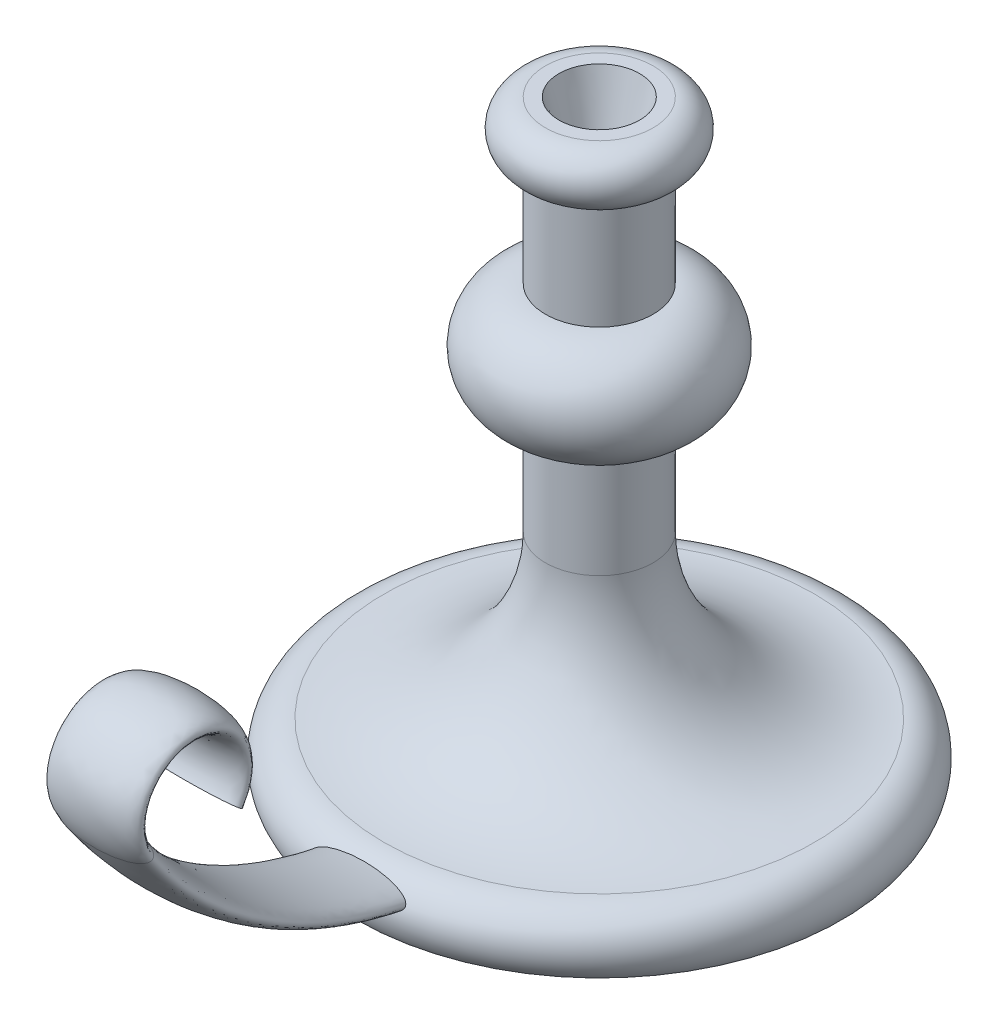
ISO-10303-21;
HEADER;
FILE_DESCRIPTION(('STEP AP214'),'2;1');
FILE_NAME('part.step','',(''),(''),'','','');
FILE_SCHEMA(('AUTOMOTIVE_DESIGN { 1 0 10303 214 1 1 1 1 }'));
ENDSEC;
DATA;
#1=APPLICATION_CONTEXT('core data for automotive mechanical design processes');
#2=APPLICATION_PROTOCOL_DEFINITION('international standard','automotive_design',2000,#1);
#3=PRODUCT_CONTEXT('',#1,'mechanical');
#4=PRODUCT('Part','Part','',(#3));
#5=PRODUCT_RELATED_PRODUCT_CATEGORY('part','',(#4));
#6=PRODUCT_DEFINITION_FORMATION('','',#4);
#7=PRODUCT_DEFINITION_CONTEXT('part definition',#1,'design');
#8=PRODUCT_DEFINITION('design','',#6,#7);
#9=PRODUCT_DEFINITION_SHAPE('','',#8);
#10=(LENGTH_UNIT() NAMED_UNIT(*) SI_UNIT(.MILLI.,.METRE.));
#11=(NAMED_UNIT(*) PLANE_ANGLE_UNIT() SI_UNIT($,.RADIAN.));
#12=(NAMED_UNIT(*) SI_UNIT($,.STERADIAN.) SOLID_ANGLE_UNIT());
#13=UNCERTAINTY_MEASURE_WITH_UNIT(LENGTH_MEASURE(1.E-05),#10,'distance_accuracy_value','');
#14=(GEOMETRIC_REPRESENTATION_CONTEXT(3) GLOBAL_UNCERTAINTY_ASSIGNED_CONTEXT((#13)) GLOBAL_UNIT_ASSIGNED_CONTEXT((#10,
#11,#12)) REPRESENTATION_CONTEXT('',''));
#15=CARTESIAN_POINT('',(0.,0.,0.));
#16=DIRECTION('',(0.,0.,1.));
#17=DIRECTION('',(1.,0.,0.));
#18=AXIS2_PLACEMENT_3D('',#15,#16,#17);
#19=CARTESIAN_POINT('',(0.,0.,0.));
#20=DIRECTION('',(0.,-1.,0.));
#21=DIRECTION('',(0.,0.,-1.));
#22=AXIS2_PLACEMENT_3D('',#19,#20,#21);
#23=PLANE('',#22);
#24=CARTESIAN_POINT('',(0.,0.,0.));
#25=DIRECTION('',(0.,-1.,0.));
#26=DIRECTION('',(0.,0.,-1.));
#27=AXIS2_PLACEMENT_3D('',#24,#25,#26);
#28=CIRCLE('',#27,90.);
#29=CARTESIAN_POINT('',(0.,0.,-90.));
#30=VERTEX_POINT('',#29);
#31=EDGE_CURVE('E78',#30,#30,#28,.T.);
#32=ORIENTED_EDGE('',*,*,#31,.T.);
#33=EDGE_LOOP('',(#32));
#34=FACE_BOUND('',#33,.T.);
#35=ADVANCED_FACE('F38',(#34),#23,.T.);
#36=CARTESIAN_POINT('',(0.,220.,0.));
#37=DIRECTION('',(0.,1.,0.));
#38=DIRECTION('',(0.,0.,1.));
#39=AXIS2_PLACEMENT_3D('',#36,#37,#38);
#40=PLANE('',#39);
#41=CARTESIAN_POINT('',(0.,220.,0.));
#42=DIRECTION('',(0.,1.,0.));
#43=DIRECTION('',(0.,0.,1.));
#44=AXIS2_PLACEMENT_3D('',#41,#42,#43);
#45=CIRCLE('',#44,15.);
#46=CARTESIAN_POINT('',(0.,220.,15.));
#47=VERTEX_POINT('',#46);
#48=EDGE_CURVE('E94',#47,#47,#45,.T.);
#49=ORIENTED_EDGE('',*,*,#48,.F.);
#50=EDGE_LOOP('',(#49));
#51=FACE_BOUND('',#50,.T.);
#52=CARTESIAN_POINT('',(0.,220.,0.));
#53=DIRECTION('',(0.,-1.,0.));
#54=DIRECTION('',(0.,0.,-1.));
#55=AXIS2_PLACEMENT_3D('',#52,#53,#54);
#56=CIRCLE('',#55,20.);
#57=CARTESIAN_POINT('',(0.,220.,-20.));
#58=VERTEX_POINT('',#57);
#59=EDGE_CURVE('E50',#58,#58,#56,.T.);
#60=ORIENTED_EDGE('',*,*,#59,.F.);
#61=EDGE_LOOP('',(#60));
#62=FACE_BOUND('',#61,.T.);
#63=ADVANCED_FACE('F101',(#51,#62),#40,.T.);
#64=CARTESIAN_POINT('',(0.,210.,0.));
#65=DIRECTION('',(0.,-1.,0.));
#66=DIRECTION('',(0.,0.,-1.));
#67=AXIS2_PLACEMENT_3D('',#64,#65,#66);
#68=TOROIDAL_SURFACE('',#67,20.,10.);
#69=ORIENTED_EDGE('',*,*,#59,.T.);
#70=EDGE_LOOP('',(#69));
#71=FACE_BOUND('',#70,.T.);
#72=CARTESIAN_POINT('',(0.,200.,0.));
#73=DIRECTION('',(0.,-1.,0.));
#74=DIRECTION('',(0.,0.,-1.));
#75=AXIS2_PLACEMENT_3D('',#72,#73,#74);
#76=CIRCLE('',#75,20.);
#77=CARTESIAN_POINT('',(0.,200.,-20.));
#78=VERTEX_POINT('',#77);
#79=EDGE_CURVE('E55',#78,#78,#76,.T.);
#80=ORIENTED_EDGE('',*,*,#79,.F.);
#81=EDGE_LOOP('',(#80));
#82=FACE_BOUND('',#81,.T.);
#83=ADVANCED_FACE('F104',(#71,#82),#68,.T.);
#84=CARTESIAN_POINT('',(0.,0.,0.));
#85=DIRECTION('',(0.,-1.,0.));
#86=DIRECTION('',(0.,0.,-1.));
#87=AXIS2_PLACEMENT_3D('',#84,#85,#86);
#88=CYLINDRICAL_SURFACE('',#87,20.);
#89=ORIENTED_EDGE('',*,*,#79,.T.);
#90=EDGE_LOOP('',(#89));
#91=FACE_BOUND('',#90,.T.);
#92=CARTESIAN_POINT('',(0.,160.,0.));
#93=DIRECTION('',(0.,-1.,0.));
#94=DIRECTION('',(0.,0.,-1.));
#95=AXIS2_PLACEMENT_3D('',#92,#93,#94);
#96=CIRCLE('',#95,20.);
#97=CARTESIAN_POINT('',(0.,160.,-20.));
#98=VERTEX_POINT('',#97);
#99=EDGE_CURVE('E60',#98,#98,#96,.T.);
#100=ORIENTED_EDGE('',*,*,#99,.F.);
#101=EDGE_LOOP('',(#100));
#102=FACE_BOUND('',#101,.T.);
#103=ADVANCED_FACE('F109',(#91,#102),#88,.T.);
#104=CARTESIAN_POINT('',(0.,140.,0.));
#105=DIRECTION('',(0.,-1.,0.));
#106=DIRECTION('',(0.,0.,-1.));
#107=AXIS2_PLACEMENT_3D('',#104,#105,#106);
#108=TOROIDAL_SURFACE('',#107,20.,20.);
#109=ORIENTED_EDGE('',*,*,#99,.T.);
#110=EDGE_LOOP('',(#109));
#111=FACE_BOUND('',#110,.T.);
#112=CARTESIAN_POINT('',(0.,120.,0.));
#113=DIRECTION('',(0.,-1.,0.));
#114=DIRECTION('',(0.,0.,-1.));
#115=AXIS2_PLACEMENT_3D('',#112,#113,#114);
#116=CIRCLE('',#115,20.);
#117=CARTESIAN_POINT('',(0.,120.,-20.));
#118=VERTEX_POINT('',#117);
#119=EDGE_CURVE('E66',#118,#118,#116,.T.);
#120=ORIENTED_EDGE('',*,*,#119,.F.);
#121=EDGE_LOOP('',(#120));
#122=FACE_BOUND('',#121,.T.);
#123=ADVANCED_FACE('F116',(#111,#122),#108,.T.);
#124=CARTESIAN_POINT('',(0.,0.,0.));
#125=DIRECTION('',(0.,-1.,0.));
#126=DIRECTION('',(0.,0.,-1.));
#127=AXIS2_PLACEMENT_3D('',#124,#125,#126);
#128=CYLINDRICAL_SURFACE('',#127,20.);
#129=ORIENTED_EDGE('',*,*,#119,.T.);
#130=EDGE_LOOP('',(#129));
#131=FACE_BOUND('',#130,.T.);
#132=CARTESIAN_POINT('',(0.,80.,0.));
#133=DIRECTION('',(0.,-1.,0.));
#134=DIRECTION('',(0.,0.,-1.));
#135=AXIS2_PLACEMENT_3D('',#132,#133,#134);
#136=CIRCLE('',#135,20.);
#137=CARTESIAN_POINT('',(0.,80.,-20.));
#138=VERTEX_POINT('',#137);
#139=EDGE_CURVE('E70',#138,#138,#136,.T.);
#140=ORIENTED_EDGE('',*,*,#139,.F.);
#141=EDGE_LOOP('',(#140));
#142=FACE_BOUND('',#141,.T.);
#143=ADVANCED_FACE('F120',(#131,#142),#128,.T.);
#144=CARTESIAN_POINT('',(0.,80.,0.));
#145=DIRECTION('',(0.,-1.,0.));
#146=DIRECTION('',(0.,0.,-1.));
#147=AXIS2_PLACEMENT_3D('',#144,#145,#146);
#148=TOROIDAL_SURFACE('',#147,80.,60.);
#149=ORIENTED_EDGE('',*,*,#139,.T.);
#150=EDGE_LOOP('',(#149));
#151=FACE_BOUND('',#150,.T.);
#152=CARTESIAN_POINT('',(0.,20.,0.));
#153=DIRECTION('',(0.,-1.,0.));
#154=DIRECTION('',(0.,0.,-1.));
#155=AXIS2_PLACEMENT_3D('',#152,#153,#154);
#156=CIRCLE('',#155,80.);
#157=CARTESIAN_POINT('',(0.,20.,-80.));
#158=VERTEX_POINT('',#157);
#159=EDGE_CURVE('E74',#158,#158,#156,.T.);
#160=ORIENTED_EDGE('',*,*,#159,.F.);
#161=EDGE_LOOP('',(#160));
#162=FACE_BOUND('',#161,.T.);
#163=ADVANCED_FACE('F124',(#151,#162),#148,.F.);
#164=CARTESIAN_POINT('',(0.,7.50000000000001,0.));
#165=DIRECTION('',(0.,-1.,0.));
#166=DIRECTION('',(0.,0.,-1.));
#167=AXIS2_PLACEMENT_3D('',#164,#165,#166);
#168=TOROIDAL_SURFACE('',#167,80.,12.5);
#169=CARTESIAN_POINT('',(17.5,12.9414346567556,89.5597422043342));
#170=CARTESIAN_POINT('',(17.4999996776707,12.9834100865229,89.5390618403561));
#171=CARTESIAN_POINT('',(17.4978446678338,13.0254349004938,89.5184817634659));
#172=CARTESIAN_POINT('',(17.4892861575811,13.1092324497794,89.4776811982743));
#173=CARTESIAN_POINT('',(17.4828811168849,13.1510050881611,89.457460843071));
#174=CARTESIAN_POINT('',(17.4575154450276,13.2754779151414,89.397540281121));
#175=CARTESIAN_POINT('',(17.4324042670614,13.357332519418,89.3585808220613));
#176=CARTESIAN_POINT('',(17.3597430943198,13.5379179993389,89.2734407804368));
#177=CARTESIAN_POINT('',(17.3079906529225,13.6353152430682,89.2281116968574));
#178=CARTESIAN_POINT('',(17.1881654215547,13.8217570109409,89.142156713761));
#179=CARTESIAN_POINT('',(17.1200583326704,13.9107834263932,89.1015409681601));
#180=CARTESIAN_POINT('',(16.9825317839867,14.0690063055582,89.0298799325305));
#181=CARTESIAN_POINT('',(16.9145677994464,14.1392491335227,88.9982856031081));
#182=CARTESIAN_POINT('',(16.7722502997375,14.2742914925202,88.9378435588022));
#183=CARTESIAN_POINT('',(16.6978916893925,14.3390866000317,88.9089980734782));
#184=CARTESIAN_POINT('',(16.544217780153,14.4639626152392,88.8536099995594));
#185=CARTESIAN_POINT('',(16.4648905452803,14.5240313225779,88.8270733532936));
#186=CARTESIAN_POINT('',(16.302586394246,14.6398576639347,88.7760376587063));
#187=CARTESIAN_POINT('',(16.219610653644,14.6956166708123,88.7515379613228));
#188=CARTESIAN_POINT('',(16.052427362784,14.8023169553036,88.704732820549));
#189=CARTESIAN_POINT('',(15.9682752160745,14.8533308765833,88.6823939519366));
#190=CARTESIAN_POINT('',(15.7977416210759,14.9521540950118,88.639155365759));
#191=CARTESIAN_POINT('',(15.711359801597,14.9999628537458,88.6182558899722));
#192=CARTESIAN_POINT('',(15.4492483073625,15.1392585624723,88.5573681790009));
#193=CARTESIAN_POINT('',(15.2707999543232,15.2264609786255,88.5192579811328));
#194=CARTESIAN_POINT('',(14.9088289385943,15.3916731276291,88.4468979005836));
#195=CARTESIAN_POINT('',(14.725302105289,15.4696750103546,88.4126513155026));
#196=CARTESIAN_POINT('',(14.3538259785735,15.6182965032923,88.347139159504));
#197=CARTESIAN_POINT('',(14.1658608782526,15.6888824046966,88.3158872528146));
#198=CARTESIAN_POINT('',(13.7874003918539,15.8233792512431,88.2560127035516));
#199=CARTESIAN_POINT('',(13.5969079973402,15.8872974109117,88.2273872233003));
#200=CARTESIAN_POINT('',(13.2138496737789,16.0094159388249,88.1723348827448));
#201=CARTESIAN_POINT('',(13.0212842768929,16.06761773743,88.1459074726895));
#202=CARTESIAN_POINT('',(12.5849658119246,16.1932687928886,88.0884248304701));
#203=CARTESIAN_POINT('',(12.3407253521733,16.2592725226906,88.0579162002184));
#204=CARTESIAN_POINT('',(11.850180346078,16.3844358500306,87.9994625659014));
#205=CARTESIAN_POINT('',(11.6038755919221,16.4435947494062,87.9715178234088));
#206=CARTESIAN_POINT('',(11.1095299870478,16.5558889779776,87.9178897421858));
#207=CARTESIAN_POINT('',(10.8614883492399,16.6090213595568,87.8922075114269));
#208=CARTESIAN_POINT('',(10.3640943607017,16.7098546386226,87.8429155378603));
#209=CARTESIAN_POINT('',(10.114741947821,16.7575552760879,87.8193058942812));
#210=CARTESIAN_POINT('',(9.3663139664489,16.8930622945828,87.7514718906047));
#211=CARTESIAN_POINT('',(8.86564202060305,16.97354616682,87.710111419914));
#212=CARTESIAN_POINT('',(7.86153551840219,17.1178657179368,87.6344118706353));
#213=CARTESIAN_POINT('',(7.35810155802555,17.1817048544489,87.6000713341079));
#214=CARTESIAN_POINT('',(6.35225136111865,17.2943697092708,87.5383679228554));
#215=CARTESIAN_POINT('',(5.84984753787547,17.3432843238913,87.5109639050819));
#216=CARTESIAN_POINT('',(4.84354228831002,17.4279603163538,87.4628391630611));
#217=CARTESIAN_POINT('',(4.33964063194081,17.4637195559667,87.4421195253373));
#218=CARTESIAN_POINT('',(3.33084363886005,17.5229738360405,87.4074386787954));
#219=CARTESIAN_POINT('',(2.82594821558673,17.5464677559495,87.3934780874882));
#220=CARTESIAN_POINT('',(1.81615213380796,17.5817273168609,87.3724154174235));
#221=CARTESIAN_POINT('',(1.31125206554513,17.5935055508652,87.3653059747339));
#222=CARTESIAN_POINT('',(0.301318309132838,17.6056484066489,87.3579750479625));
#223=CARTESIAN_POINT('',(-0.20371536002616,17.6060141977103,87.357752858235));
#224=CARTESIAN_POINT('',(-1.21356726554176,17.5953454261038,87.3641963426439));
#225=CARTESIAN_POINT('',(-1.71838551945515,17.5843121142068,87.3708612610896));
#226=CARTESIAN_POINT('',(-2.60695068649859,17.554616306541,87.3886163883338));
#227=CARTESIAN_POINT('',(-2.99081046478846,17.5384060734754,87.3982690399213));
#228=CARTESIAN_POINT('',(-3.75807002785719,17.4990063104014,87.421496688066));
#229=CARTESIAN_POINT('',(-4.14146979585435,17.4758165331044,87.435071823598));
#230=CARTESIAN_POINT('',(-4.90767543763217,17.4221255760208,87.4661109016121));
#231=CARTESIAN_POINT('',(-5.29048118303767,17.3916229911934,87.4835755913649));
#232=CARTESIAN_POINT('',(-6.05728766608045,17.3226675403927,87.52247652696));
#233=CARTESIAN_POINT('',(-6.44128353835451,17.2841722314846,87.5439339089184));
#234=CARTESIAN_POINT('',(-7.20803081067567,17.1987228636429,87.5907685418077));
#235=CARTESIAN_POINT('',(-7.59078241304241,17.1517702579396,87.6161451191906));
#236=CARTESIAN_POINT('',(-8.35453102594126,17.0486132676472,87.6708875244929));
#237=CARTESIAN_POINT('',(-8.73552894189147,16.9924143825779,87.7002509792864));
#238=CARTESIAN_POINT('',(-9.40362807317358,16.8844873931684,87.7555693385742));
#239=CARTESIAN_POINT('',(-9.69115955865574,16.8349635590468,87.7806318626291));
#240=CARTESIAN_POINT('',(-10.2648242071224,16.7293167465828,87.8333287645208));
#241=CARTESIAN_POINT('',(-10.5509571522124,16.6731927720484,87.8609635304672));
#242=CARTESIAN_POINT('',(-11.1217112831614,16.5534902310351,87.9190678138249));
#243=CARTESIAN_POINT('',(-11.4063304543326,16.4899035134825,87.9495404231884));
#244=CARTESIAN_POINT('',(-11.9738772339478,16.3541216812726,88.0137266324376));
#245=CARTESIAN_POINT('',(-12.25679925459,16.2819065762201,88.0474477220507));
#246=CARTESIAN_POINT('',(-12.817582109759,16.1280994435203,88.1183718381953));
#247=CARTESIAN_POINT('',(-13.0954641920684,16.046573796357,88.1555499028383));
#248=CARTESIAN_POINT('',(-13.6468218234689,15.8719007074313,88.2343580118385));
#249=CARTESIAN_POINT('',(-13.9202995902184,15.7787593350284,88.2759857295859));
#250=CARTESIAN_POINT('',(-14.3254052817093,15.6283840406489,88.342656822394));
#251=CARTESIAN_POINT('',(-14.4594023169282,15.5765627213431,88.3655500017785));
#252=CARTESIAN_POINT('',(-14.7254525655377,15.4688611687534,88.4129882653633));
#253=CARTESIAN_POINT('',(-14.8575059894889,15.4129813790935,88.4375331689951));
#254=CARTESIAN_POINT('',(-15.1188747284345,15.296726972035,88.4884967907573));
#255=CARTESIAN_POINT('',(-15.2481958098581,15.2363633637365,88.5149109123159));
#256=CARTESIAN_POINT('',(-15.5037035642083,15.110317900121,88.5700241751772));
#257=CARTESIAN_POINT('',(-15.6298910063175,15.0446373670988,88.5987227483177));
#258=CARTESIAN_POINT('',(-15.8704199707061,14.9113179601608,88.6570151826478));
#259=CARTESIAN_POINT('',(-15.9850095995262,14.8440563407288,88.6864417367861));
#260=CARTESIAN_POINT('',(-16.2094581395954,14.7030103830826,88.7482816567769));
#261=CARTESIAN_POINT('',(-16.319313055117,14.629220689998,88.7806974756141));
#262=CARTESIAN_POINT('',(-16.5315146626624,14.474563961653,88.8489097184972));
#263=CARTESIAN_POINT('',(-16.6339121024917,14.393755019161,88.8846785573508));
#264=CARTESIAN_POINT('',(-16.8291907541923,14.2232561160766,88.9606113704154));
#265=CARTESIAN_POINT('',(-16.9220882016583,14.1335818404865,89.0007675950254));
#266=CARTESIAN_POINT('',(-17.0411637727685,14.0021924630804,89.0601235459873));
#267=CARTESIAN_POINT('',(-17.073294917827,13.9648250339926,89.0770574086406));
#268=CARTESIAN_POINT('',(-17.1351129203989,13.8885105828122,89.1117704043089));
#269=CARTESIAN_POINT('',(-17.1647999427302,13.8495636674961,89.1295494801999));
#270=CARTESIAN_POINT('',(-17.2496672583031,13.7301865324197,89.1842722230348));
#271=CARTESIAN_POINT('',(-17.3006362954167,13.6472387371286,89.2225929343976));
#272=CARTESIAN_POINT('',(-17.3659392171785,13.5177923286576,89.2830198855204));
#273=CARTESIAN_POINT('',(-17.385944655127,13.473489983239,89.3038035106326));
#274=CARTESIAN_POINT('',(-17.421521231844,13.3835498526411,89.3462357272131));
#275=CARTESIAN_POINT('',(-17.4370949768747,13.3379128698457,89.3678838017236));
#276=CARTESIAN_POINT('',(-17.4633118273198,13.2456714845447,89.411904802424));
#277=CARTESIAN_POINT('',(-17.4739627514632,13.1990687398023,89.4342765183816));
#278=CARTESIAN_POINT('',(-17.4900003628641,13.1052444737537,89.4796070415907));
#279=CARTESIAN_POINT('',(-17.495387819971,13.0580230439622,89.5025657624809));
#280=CARTESIAN_POINT('',(-17.5004320668286,12.9684112208445,89.5464271716019));
#281=CARTESIAN_POINT('',(-17.5006298436875,12.9260327119426,89.5672934245652));
#282=CARTESIAN_POINT('',(-17.496667300483,12.8415284156483,89.6091580078857));
#283=CARTESIAN_POINT('',(-17.4925055351934,12.799402716722,89.6301563797469));
#284=CARTESIAN_POINT('',(-17.479965082583,12.7157496198107,89.6721156351431));
#285=CARTESIAN_POINT('',(-17.4715847960013,12.6742224548788,89.693076501433));
#286=CARTESIAN_POINT('',(-17.450862522026,12.5920532516238,89.7348115258834));
#287=CARTESIAN_POINT('',(-17.4385183877269,12.5514117057388,89.7555855765781));
#288=CARTESIAN_POINT('',(-17.4070626989759,12.4623676182576,89.8013847331777));
#289=CARTESIAN_POINT('',(-17.3870577635768,12.4142402057078,89.8263321178975));
#290=CARTESIAN_POINT('',(-17.3423007335127,12.3198942829529,89.8756026524763));
#291=CARTESIAN_POINT('',(-17.317545140678,12.2736772101063,89.8999253272692));
#292=CARTESIAN_POINT('',(-17.2371059859824,12.1379719567038,89.9718636752115));
#293=CARTESIAN_POINT('',(-17.1752845379972,12.0515209207989,90.0184026508769));
#294=CARTESIAN_POINT('',(-17.0502729237444,11.8991704299986,90.1015176697339));
#295=CARTESIAN_POINT('',(-16.9886971231213,11.8321383297489,90.1385373685485));
#296=CARTESIAN_POINT('',(-16.8591573255861,11.7032426034951,90.2104869329279));
#297=CARTESIAN_POINT('',(-16.7911883686366,11.6413830620089,90.24541514088));
#298=CARTESIAN_POINT('',(-16.6502911436156,11.5222099067342,90.3133841124366));
#299=CARTESIAN_POINT('',(-16.5773538074549,11.4649050425,90.3464212107125));
#300=CARTESIAN_POINT('',(-16.4277349965839,11.3544143267811,90.4107258034175));
#301=CARTESIAN_POINT('',(-16.3510544874357,11.3012274221162,90.441993749758));
#302=CARTESIAN_POINT('',(-16.1853189525368,11.1922810586095,90.5066142435688));
#303=CARTESIAN_POINT('',(-16.0958847835329,11.1369814833085,90.5397652495639));
#304=CARTESIAN_POINT('',(-15.9140859303204,11.0303194621556,90.6043042941242));
#305=CARTESIAN_POINT('',(-15.8217209538334,10.9789574107339,90.6356921559876));
#306=CARTESIAN_POINT('',(-15.6347974994411,10.879769884165,90.6968383877971));
#307=CARTESIAN_POINT('',(-15.5402427441418,10.8319389137696,90.7265992701637));
#308=CARTESIAN_POINT('',(-15.3492353522603,10.739329513768,90.7846969346252));
#309=CARTESIAN_POINT('',(-15.2527828201661,10.6945509167065,90.8130337948204));
#310=CARTESIAN_POINT('',(-15.027731983768,10.5940589597548,90.877121220524));
#311=CARTESIAN_POINT('',(-14.8985593440138,10.5393328792864,90.9124022819658));
#312=CARTESIAN_POINT('',(-14.6380328432605,10.4339610325183,90.9809741103802));
#313=CARTESIAN_POINT('',(-14.5066786763343,10.3833158444316,91.0142645951403));
#314=CARTESIAN_POINT('',(-14.1096810918776,10.2366440116075,91.1115171918214));
#315=CARTESIAN_POINT('',(-13.8413800425914,10.1460018602113,91.1727828792967));
#316=CARTESIAN_POINT('',(-13.2997906638453,9.97615455726898,91.2892862812461));
#317=CARTESIAN_POINT('',(-13.026499455453,9.89695625887021,91.3445203789089));
#318=CARTESIAN_POINT('',(-12.4748594155941,9.7476965486625,91.4499805719981));
#319=CARTESIAN_POINT('',(-12.1964912536691,9.67768673078002,91.5001780442573));
#320=CARTESIAN_POINT('',(-11.6372393425736,9.54592534416371,91.5957501918069));
#321=CARTESIAN_POINT('',(-11.3563577087898,9.48416742117614,91.6411285723794));
#322=CARTESIAN_POINT('',(-10.7925089006667,9.36779787162533,91.7275132616965));
#323=CARTESIAN_POINT('',(-10.5095420692673,9.31318509647909,91.7685202729422));
#324=CARTESIAN_POINT('',(-9.913871502135,9.20520508711792,91.8503345045438));
#325=CARTESIAN_POINT('',(-9.60099168323477,9.15249390095798,91.890721774449));
#326=CARTESIAN_POINT('',(-8.97359688181807,9.05389158705519,91.966921819911));
#327=CARTESIAN_POINT('',(-8.6590818181578,9.00800080116124,92.0027343661631));
#328=CARTESIAN_POINT('',(-8.02865568808609,8.92240020575294,92.0700329889401));
#329=CARTESIAN_POINT('',(-7.71274422766323,8.88269227276183,92.101517751625));
#330=CARTESIAN_POINT('',(-7.07986626810436,8.80898713679294,92.1603325838504));
#331=CARTESIAN_POINT('',(-6.76289973059222,8.77499014390489,92.187662500542));
#332=CARTESIAN_POINT('',(-5.81249868362052,8.68114273902088,92.2635030013651));
#333=CARTESIAN_POINT('',(-5.17778747193672,8.62919999492182,92.3060517448554));
#334=CARTESIAN_POINT('',(-3.90627938186643,8.54431318450682,92.3760091017525));
#335=CARTESIAN_POINT('',(-3.26948240305101,8.51137004695181,92.4034169750229));
#336=CARTESIAN_POINT('',(-1.9954574177825,8.46331702284115,92.4435085691828));
#337=CARTESIAN_POINT('',(-1.35823064985221,8.44818761908844,92.4562084043365));
#338=CARTESIAN_POINT('',(-0.0834423270794723,8.43517103988552,92.4671302630246));
#339=CARTESIAN_POINT('',(0.554119245389432,8.43728488791034,92.4653514271759));
#340=CARTESIAN_POINT('',(1.82886328297131,8.45883344750925,92.4472853754492));
#341=CARTESIAN_POINT('',(2.46604565478247,8.47827140120332,92.4309954438923));
#342=CARTESIAN_POINT('',(3.73902583867163,8.53514174464801,92.3836590626409));
#343=CARTESIAN_POINT('',(4.37482378215666,8.5725723444523,92.3526140808133));
#344=CARTESIAN_POINT('',(5.3662554446114,8.64621329195008,92.2921790866403));
#345=CARTESIAN_POINT('',(5.72271555902021,8.67578736963493,92.2680118235607));
#346=CARTESIAN_POINT('',(6.43465819603442,8.74146404735404,92.2147013952353));
#347=CARTESIAN_POINT('',(6.79014074848117,8.77756644580552,92.1855583836332));
#348=CARTESIAN_POINT('',(7.49983836059608,8.85679311513365,92.1221127048892));
#349=CARTESIAN_POINT('',(7.85405350646585,8.89991689880836,92.0878103957547));
#350=CARTESIAN_POINT('',(8.56089767224029,8.99384143269664,92.0137981226249));
#351=CARTESIAN_POINT('',(8.91352674331447,9.04464193338996,91.9740883343957));
#352=CARTESIAN_POINT('',(9.51226790233212,9.13842562293732,91.9015818240062));
#353=CARTESIAN_POINT('',(9.75889575934295,9.17924629619451,91.870237065407));
#354=CARTESIAN_POINT('',(10.2509419620311,9.26550036635928,91.8045624920056));
#355=CARTESIAN_POINT('',(10.4963603397385,9.31093364041786,91.7702327567069));
#356=CARTESIAN_POINT('',(10.9855805665744,9.40685898724898,91.698426646327));
#357=CARTESIAN_POINT('',(11.2293833718175,9.45734771681981,91.6609523533815));
#358=CARTESIAN_POINT('',(11.7151775621055,9.56401317099042,91.5826038967891));
#359=CARTESIAN_POINT('',(11.9571690234582,9.62018965451332,91.5417298772536));
#360=CARTESIAN_POINT('',(12.5384162018491,9.76351210996402,91.4386423376746));
#361=CARTESIAN_POINT('',(12.8765786557778,9.85386844470762,91.3745858903287));
#362=CARTESIAN_POINT('',(13.3793136041317,10.0014015523808,91.2720163238265));
#363=CARTESIAN_POINT('',(13.5462966135012,10.0526332971695,91.2367090969991));
#364=CARTESIAN_POINT('',(13.878285337956,10.159626184162,91.1637294936456));
#365=CARTESIAN_POINT('',(14.0432911413079,10.2153871233021,91.126057223172));
#366=CARTESIAN_POINT('',(14.3844416693133,10.336938272787,91.0448513753996));
#367=CARTESIAN_POINT('',(14.5603739146119,10.40317678906,91.0010908407914));
#368=CARTESIAN_POINT('',(14.9085311659835,10.54285093242,90.9100440331645));
#369=CARTESIAN_POINT('',(15.0807549132318,10.6162889577865,90.8627565865344));
#370=CARTESIAN_POINT('',(15.4195496037307,10.7715651970483,90.7642492199853));
#371=CARTESIAN_POINT('',(15.5861368065588,10.853375906557,90.7130423069865));
#372=CARTESIAN_POINT('',(15.9120386126952,11.0275348916431,90.6058220172112));
#373=CARTESIAN_POINT('',(16.0713593593327,11.1198740259083,90.5498128203451));
#374=CARTESIAN_POINT('',(16.3465910082043,11.2969255920343,90.4444082893049));
#375=CARTESIAN_POINT('',(16.4645448336192,11.3791055101427,90.3961277047703));
#376=CARTESIAN_POINT('',(16.6911566146553,11.5538633486869,90.2950977924847));
#377=CARTESIAN_POINT('',(16.7997939840169,11.6464633011956,90.2423390562531));
#378=CARTESIAN_POINT('',(16.9524870890688,11.7953014200275,90.1590440243456));
#379=CARTESIAN_POINT('',(17.0019977189783,11.8469859215399,90.1303607600846));
#380=CARTESIAN_POINT('',(17.0963102611101,11.9538274561512,90.0716181087374));
#381=CARTESIAN_POINT('',(17.1411110817341,12.0089852895526,90.0415584049393));
#382=CARTESIAN_POINT('',(17.2246441347399,12.1227246632092,89.9801756575595));
#383=CARTESIAN_POINT('',(17.2633984155373,12.1812926416251,89.948857753765));
#384=CARTESIAN_POINT('',(17.3335784406432,12.3020144005064,89.8849549671328));
#385=CARTESIAN_POINT('',(17.3650107233705,12.3641649194657,89.8523712452273));
#386=CARTESIAN_POINT('',(17.4092508881815,12.4687258013538,89.7981176909033));
#387=CARTESIAN_POINT('',(17.4246893204628,12.5101841078547,89.7767436177655));
#388=CARTESIAN_POINT('',(17.4515182330193,12.5942336377179,89.7336969050674));
#389=CARTESIAN_POINT('',(17.4629102408533,12.6368244270181,89.7120243813912));
#390=CARTESIAN_POINT('',(17.4812886417918,12.7228207531293,89.6685521390583));
#391=CARTESIAN_POINT('',(17.488280453409,12.7662252198271,89.6467526103346));
#392=CARTESIAN_POINT('',(17.4976362320133,12.8535466229689,89.6031794397246));
#393=CARTESIAN_POINT('',(17.5000003376542,12.8974635440192,89.5814057970823));
#394=CARTESIAN_POINT('',(17.5,12.9414346567556,89.5597422043342));
#395=B_SPLINE_CURVE_WITH_KNOTS('',3,(#169,#170,#171,#172,#173,#174,#175,#176,#177,#178,#179,
#180,#181,#182,#183,#184,#185,#186,#187,#188,#189,#190,#191,#192,#193,#194,#195,#196,#197,#198,
#199,#200,#201,#202,#203,#204,#205,#206,#207,#208,#209,#210,#211,#212,#213,#214,#215,#216,#217,
#218,#219,#220,#221,#222,#223,#224,#225,#226,#227,#228,#229,#230,#231,#232,#233,#234,#235,#236,
#237,#238,#239,#240,#241,#242,#243,#244,#245,#246,#247,#248,#249,#250,#251,#252,#253,#254,#255,
#256,#257,#258,#259,#260,#261,#262,#263,#264,#265,#266,#267,#268,#269,#270,#271,#272,#273,#274,
#275,#276,#277,#278,#279,#280,#281,#282,#283,#284,#285,#286,#287,#288,#289,#290,#291,#292,#293,
#294,#295,#296,#297,#298,#299,#300,#301,#302,#303,#304,#305,#306,#307,#308,#309,#310,#311,#312,
#313,#314,#315,#316,#317,#318,#319,#320,#321,#322,#323,#324,#325,#326,#327,#328,#329,#330,#331,
#332,#333,#334,#335,#336,#337,#338,#339,#340,#341,#342,#343,#344,#345,#346,#347,#348,#349,#350,
#351,#352,#353,#354,#355,#356,#357,#358,#359,#360,#361,#362,#363,#364,#365,#366,#367,#368,#369,
#370,#371,#372,#373,#374,#375,#376,#377,#378,#379,#380,#381,#382,#383,#384,#385,#386,#387,#388,
#389,#390,#391,#392,#393,#394),.UNSPECIFIED.,.T.,.F.,(4,2,2,2,2,2,2,2,2,2,2,2,2,2,2,2,2,2,2,2,2,
2,2,2,2,2,2,2,2,2,2,2,2,2,2,2,2,2,2,2,2,2,2,2,2,2,2,2,2,2,2,2,2,2,2,2,2,2,2,2,2,2,2,2,2,2,2,2,2,
2,2,2,2,2,2,2,2,2,2,2,2,2,2,2,2,2,2,2,2,2,2,2,2,2,2,2,2,2,2,2,2,2,2,2,2,2,2,2,2,2,2,2,4),(0.,
0.140326879649314,0.280704643844309,0.561461806499938,0.917225717585792,1.27374235386083,
1.58146302398145,1.8894311959364,2.19816989275474,2.50680983170024,2.80944292372748,
3.11212672643255,3.71838915770192,4.32516518168246,4.93458970782544,5.54334784093537,
6.15195325906649,6.91631911029047,7.68076285707089,8.44557890144728,9.21043154271132,
10.7363530227228,12.2619572680851,13.7782885580524,15.2948661984783,16.8115823682402,
18.3266664767785,19.8415953542036,21.3563580231468,22.5092504482308,23.6621837256809,
24.8153386988898,25.9747813799631,27.1340250219355,28.2925816429425,29.1710242088839,
30.0495995331115,30.9291435591543,31.8107663507035,32.6864555684208,33.5616891298976,
33.9980703124478,34.4344038665404,34.8696994156048,35.3048870393031,35.7129485465614,
36.1213479397353,36.5266413619585,36.931230132163,37.0874810726011,37.2437214677038,
37.5562829439449,37.7147148343191,37.8730533580127,38.0311395270883,38.1892025705742,
38.3307149014329,38.4722741597123,38.6138871242241,38.7555769191151,38.9286541005773,
39.1018592207181,39.448590135234,39.7429975955386,40.0376353818192,40.3328261359408,
40.6279411430423,40.9585479808937,41.2891878931731,41.6193018978018,41.9493977775693,
42.3832551508603,42.8171738887973,43.6859467918773,44.5552378220707,45.4292182663369,
46.3025217875288,47.175684752182,48.1351081860342,49.0945796914532,50.0543418354873,
51.0141392787945,52.9283366636024,54.8426276125099,56.7548192562828,58.667124399218,
60.5797874956882,62.4922603557716,63.5676819321866,64.643070307189,65.7183840946041,
66.7936629380637,67.5494303160615,68.3051775707201,69.0604283053786,69.8156470419362,
70.8826765887359,71.4172057561805,71.9517109715334,72.5305894861732,73.1096614946438,
73.6868888443997,74.2636187787016,74.7180950553379,75.1735510009092,75.4046853668804,
75.6358731855898,75.8661972266867,76.0963147970919,76.2435550398536,76.3907396389803,
76.5377426347989,76.6847412260986),.UNSPECIFIED.);
#396=CARTESIAN_POINT('',(17.5,12.9414346567556,89.5597422043342));
#397=VERTEX_POINT('',#396);
#398=EDGE_CURVE('E10',#397,#397,#395,.T.);
#399=ORIENTED_EDGE('',*,*,#398,.F.);
#400=EDGE_LOOP('',(#399));
#401=FACE_BOUND('',#400,.T.);
#402=ORIENTED_EDGE('',*,*,#159,.T.);
#403=EDGE_LOOP('',(#402));
#404=FACE_BOUND('',#403,.T.);
#405=ORIENTED_EDGE('',*,*,#31,.F.);
#406=EDGE_LOOP('',(#405));
#407=FACE_BOUND('',#406,.T.);
#408=ADVANCED_FACE('F127',(#401,#404,#407),#168,.T.);
#409=CARTESIAN_POINT('',(0.,75.,150.634185358261));
#410=DIRECTION('',(0.,-0.823947139620552,0.566666666666666));
#411=DIRECTION('',(1.,0.,0.));
#412=AXIS2_PLACEMENT_3D('',#409,#410,#411);
#413=PLANE('',#412);
#414=CARTESIAN_POINT('',(0.,75.,150.634185358261));
#415=DIRECTION('',(0.,-0.823947139620552,0.566666666666666));
#416=DIRECTION('',(1.,0.,0.));
#417=AXIS2_PLACEMENT_3D('',#414,#415,#416);
#418=ELLIPSE('',#417,17.5,5.);
#419=CARTESIAN_POINT('',(17.5,75.,150.634185358261));
#420=VERTEX_POINT('',#419);
#421=EDGE_CURVE('E82',#420,#420,#418,.T.);
#422=ORIENTED_EDGE('',*,*,#421,.T.);
#423=EDGE_LOOP('',(#422));
#424=FACE_BOUND('',#423,.T.);
#425=ADVANCED_FACE('F132',(#424),#413,.T.);
#426=CARTESIAN_POINT('',(17.5,10.,60.));
#427=CARTESIAN_POINT('',(17.5,10.,110.410191303973));
#428=CARTESIAN_POINT('',(17.5,33.4646670673665,155.026295870831));
#429=CARTESIAN_POINT('',(17.5,75.,183.592070943083));
#430=CARTESIAN_POINT('',(17.5,20.,60.));
#431=CARTESIAN_POINT('',(17.5,20.,107.049511883708));
#432=CARTESIAN_POINT('',(17.5,41.9003559295421,148.691209479443));
#433=CARTESIAN_POINT('',(17.5,80.6666666666666,175.352599546877));
#434=CARTESIAN_POINT('',(-17.5,20.,60.));
#435=CARTESIAN_POINT('',(-17.5,20.,107.049511883708));
#436=CARTESIAN_POINT('',(-17.5,41.9003559295421,148.691209479443));
#437=CARTESIAN_POINT('',(-17.5,80.6666666666666,175.352599546877));
#438=CARTESIAN_POINT('',(-17.5,10.,60.));
#439=CARTESIAN_POINT('',(-17.5,10.,110.410191303973));
#440=CARTESIAN_POINT('',(-17.5,33.4646670673665,155.026295870831));
#441=CARTESIAN_POINT('',(-17.5,75.,183.592070943083));
#442=CARTESIAN_POINT('',(-17.5,0.,60.));
#443=CARTESIAN_POINT('',(-17.5,0.,113.770870724238));
#444=CARTESIAN_POINT('',(-17.5,25.0289782051909,161.36138226222));
#445=CARTESIAN_POINT('',(-17.5,69.3333333333333,191.831542339288));
#446=CARTESIAN_POINT('',(17.5,0.,60.));
#447=CARTESIAN_POINT('',(17.5,0.,113.770870724238));
#448=CARTESIAN_POINT('',(17.5,25.0289782051909,161.36138226222));
#449=CARTESIAN_POINT('',(17.5,69.3333333333333,191.831542339288));
#450=CARTESIAN_POINT('',(17.5,10.,60.));
#451=CARTESIAN_POINT('',(17.5,10.,110.410191303973));
#452=CARTESIAN_POINT('',(17.5,33.4646670673665,155.026295870831));
#453=CARTESIAN_POINT('',(17.5,75.,183.592070943083));
#454=(BOUNDED_SURFACE() B_SPLINE_SURFACE(3,3,((#426,#427,#428,#429),(#430,#431,#432,#433),(#434,
#435,#436,#437),(#438,#439,#440,#441),(#442,#443,#444,#445),(#446,#447,#448,#449),(#450,#451,
#452,#453)),.UNSPECIFIED.,.T.,.F.,.F.) B_SPLINE_SURFACE_WITH_KNOTS((4,3,4),(4,4),(0.,0.5,1.),
(0.,1.),.UNSPECIFIED.) GEOMETRIC_REPRESENTATION_ITEM() RATIONAL_B_SPLINE_SURFACE(((1.,
0.923374135437856,0.923374135437856,1.),(0.333333333333333,0.307791378479285,0.307791378479285,
0.333333333333333),(0.333333333333333,0.307791378479285,0.307791378479285,0.333333333333333),
(1.,0.923374135437856,0.923374135437856,1.),(0.333333333333333,0.307791378479285,
0.307791378479285,0.333333333333333),(0.333333333333333,0.307791378479285,0.307791378479285,
0.333333333333333),(1.,0.923374135437856,0.923374135437856,1.))) REPRESENTATION_ITEM('') SURFACE());
#455=CARTESIAN_POINT('',(0.,75.,183.592070943083));
#456=DIRECTION('',(0.,0.823947139620552,0.566666666666667));
#457=DIRECTION('',(1.,0.,0.));
#458=AXIS2_PLACEMENT_3D('',#455,#456,#457);
#459=ELLIPSE('',#458,17.5,5.);
#460=CARTESIAN_POINT('',(17.5,75.,183.592070943083));
#461=VERTEX_POINT('',#460);
#462=EDGE_CURVE('E86',#461,#461,#459,.T.);
#463=ORIENTED_EDGE('',*,*,#398,.T.);
#464=EDGE_LOOP('',(#463));
#465=FACE_BOUND('',#464,.T.);
#466=ORIENTED_EDGE('',*,*,#462,.F.);
#467=EDGE_LOOP('',(#466));
#468=FACE_BOUND('',#467,.T.);
#469=ADVANCED_FACE('F137',(#465,#468),#454,.T.);
#470=CARTESIAN_POINT('',(17.5,75.,183.592070943083));
#471=CARTESIAN_POINT('',(17.5,90.10642735238,193.981461744242));
#472=CARTESIAN_POINT('',(17.5,106.333333333333,185.447347211541));
#473=CARTESIAN_POINT('',(17.5,106.333333333333,167.113128150672));
#474=CARTESIAN_POINT('',(17.5,106.333333333333,148.778909089802));
#475=CARTESIAN_POINT('',(17.5,90.1064273523801,140.244794557101));
#476=CARTESIAN_POINT('',(17.5,75.,150.634185358261));
#477=CARTESIAN_POINT('',(17.5,80.6666666666667,175.352599546877));
#478=CARTESIAN_POINT('',(17.5,88.2198803428567,180.547294947457));
#479=CARTESIAN_POINT('',(17.5,96.3333333333334,176.280237681106));
#480=CARTESIAN_POINT('',(17.5,96.3333333333333,167.113128150672));
#481=CARTESIAN_POINT('',(17.5,96.3333333333333,157.946018620237));
#482=CARTESIAN_POINT('',(17.5,88.2198803428566,153.678961353886));
#483=CARTESIAN_POINT('',(17.5,80.6666666666666,158.873656754466));
#484=CARTESIAN_POINT('',(-17.5,80.6666666666667,175.352599546877));
#485=CARTESIAN_POINT('',(-17.5,88.2198803428567,180.547294947457));
#486=CARTESIAN_POINT('',(-17.5,96.3333333333334,176.280237681106));
#487=CARTESIAN_POINT('',(-17.5,96.3333333333333,167.113128150672));
#488=CARTESIAN_POINT('',(-17.5,96.3333333333333,157.946018620237));
#489=CARTESIAN_POINT('',(-17.5,88.2198803428566,153.678961353886));
#490=CARTESIAN_POINT('',(-17.5,80.6666666666666,158.873656754466));
#491=CARTESIAN_POINT('',(-17.5,75.,183.592070943083));
#492=CARTESIAN_POINT('',(-17.5,90.10642735238,193.981461744242));
#493=CARTESIAN_POINT('',(-17.5,106.333333333333,185.447347211541));
#494=CARTESIAN_POINT('',(-17.5,106.333333333333,167.113128150672));
#495=CARTESIAN_POINT('',(-17.5,106.333333333333,148.778909089802));
#496=CARTESIAN_POINT('',(-17.5,90.1064273523801,140.244794557101));
#497=CARTESIAN_POINT('',(-17.5,75.,150.634185358261));
#498=CARTESIAN_POINT('',(-17.5,69.3333333333333,191.831542339288));
#499=CARTESIAN_POINT('',(-17.5,91.9929743619034,207.415628541028));
#500=CARTESIAN_POINT('',(-17.5,116.333333333333,194.614456741976));
#501=CARTESIAN_POINT('',(-17.5,116.333333333333,167.113128150672));
#502=CARTESIAN_POINT('',(-17.5,116.333333333333,139.611799559367));
#503=CARTESIAN_POINT('',(-17.5,91.9929743619035,126.810627760316));
#504=CARTESIAN_POINT('',(-17.5,69.3333333333333,142.394713962055));
#505=CARTESIAN_POINT('',(17.5,69.3333333333333,191.831542339288));
#506=CARTESIAN_POINT('',(17.5,91.9929743619034,207.415628541028));
#507=CARTESIAN_POINT('',(17.5,116.333333333333,194.614456741976));
#508=CARTESIAN_POINT('',(17.5,116.333333333333,167.113128150672));
#509=CARTESIAN_POINT('',(17.5,116.333333333333,139.611799559367));
#510=CARTESIAN_POINT('',(17.5,91.9929743619035,126.810627760316));
#511=CARTESIAN_POINT('',(17.5,69.3333333333333,142.394713962055));
#512=CARTESIAN_POINT('',(17.5,75.,183.592070943083));
#513=CARTESIAN_POINT('',(17.5,90.10642735238,193.981461744242));
#514=CARTESIAN_POINT('',(17.5,106.333333333333,185.447347211541));
#515=CARTESIAN_POINT('',(17.5,106.333333333333,167.113128150672));
#516=CARTESIAN_POINT('',(17.5,106.333333333333,148.778909089802));
#517=CARTESIAN_POINT('',(17.5,90.1064273523801,140.244794557101));
#518=CARTESIAN_POINT('',(17.5,75.,150.634185358261));
#519=(BOUNDED_SURFACE() B_SPLINE_SURFACE(3,3,((#470,#471,#472,#473,#474,#475,#476),(#477,#478,
#479,#480,#481,#482,#483),(#484,#485,#486,#487,#488,#489,#490),(#491,#492,#493,#494,#495,#496,
#497),(#498,#499,#500,#501,#502,#503,#504),(#505,#506,#507,#508,#509,#510,#511),(#512,#513,#514,
#515,#516,#517,#518)),.UNSPECIFIED.,.T.,.F.,.F.) B_SPLINE_SURFACE_WITH_KNOTS((4,3,4),(4,3,4),
(0.,0.5,1.),(0.,0.5,1.),
.UNSPECIFIED.) GEOMETRIC_REPRESENTATION_ITEM() RATIONAL_B_SPLINE_SURFACE(((1.,0.643649778750421,
0.643649778750421,1.,0.643649778750421,0.643649778750421,1.),(0.333333333333333,
0.21454992625014,0.21454992625014,0.333333333333333,0.21454992625014,0.21454992625014,
0.333333333333333),(0.333333333333333,0.21454992625014,0.21454992625014,0.333333333333333,
0.21454992625014,0.21454992625014,0.333333333333333),(1.,0.643649778750421,0.643649778750421,1.,
0.643649778750421,0.643649778750421,1.),(0.333333333333333,0.21454992625014,0.21454992625014,
0.333333333333333,0.21454992625014,0.21454992625014,0.333333333333333),(0.333333333333333,
0.21454992625014,0.21454992625014,0.333333333333333,0.21454992625014,0.21454992625014,
0.333333333333333),(1.,0.643649778750421,0.643649778750421,1.,0.643649778750421,
0.643649778750421,1.))) REPRESENTATION_ITEM('') SURFACE());
#520=ORIENTED_EDGE('',*,*,#421,.F.);
#521=EDGE_LOOP('',(#520));
#522=FACE_BOUND('',#521,.T.);
#523=ORIENTED_EDGE('',*,*,#462,.T.);
#524=EDGE_LOOP('',(#523));
#525=FACE_BOUND('',#524,.T.);
#526=ADVANCED_FACE('F134',(#522,#525),#519,.T.);
#527=CARTESIAN_POINT('',(0.,220.,0.));
#528=DIRECTION('',(0.,1.,0.));
#529=DIRECTION('',(0.,0.,1.));
#530=AXIS2_PLACEMENT_3D('',#527,#528,#529);
#531=CONICAL_SURFACE('',#530,15.,0.26179938779915);
#532=CARTESIAN_POINT('',(0.,195.,0.));
#533=DIRECTION('',(0.,1.,0.));
#534=DIRECTION('',(0.,0.,1.));
#535=AXIS2_PLACEMENT_3D('',#532,#533,#534);
#536=CIRCLE('',#535,8.30127018922192);
#537=CARTESIAN_POINT('',(0.,195.,8.30127018922192));
#538=VERTEX_POINT('',#537);
#539=EDGE_CURVE('E90',#538,#538,#536,.T.);
#540=ORIENTED_EDGE('',*,*,#539,.F.);
#541=EDGE_LOOP('',(#540));
#542=FACE_BOUND('',#541,.T.);
#543=ORIENTED_EDGE('',*,*,#48,.T.);
#544=EDGE_LOOP('',(#543));
#545=FACE_BOUND('',#544,.T.);
#546=ADVANCED_FACE('F99',(#542,#545),#531,.F.);
#547=CARTESIAN_POINT('',(0.,195.,0.));
#548=DIRECTION('',(0.,1.,0.));
#549=DIRECTION('',(0.,0.,1.));
#550=AXIS2_PLACEMENT_3D('',#547,#548,#549);
#551=PLANE('',#550);
#552=ORIENTED_EDGE('',*,*,#539,.T.);
#553=EDGE_LOOP('',(#552));
#554=FACE_BOUND('',#553,.T.);
#555=ADVANCED_FACE('F160',(#554),#551,.T.);
#556=CLOSED_SHELL('',(#35,#63,#83,#103,#123,#143,#163,#408,#425,#469,#526,#546,#555));
#557=MANIFOLD_SOLID_BREP('B2',#556);
#558=ADVANCED_BREP_SHAPE_REPRESENTATION('',(#18,#557),#14);
#559=SHAPE_DEFINITION_REPRESENTATION(#9,#558);
ENDSEC;
END-ISO-10303-21;
